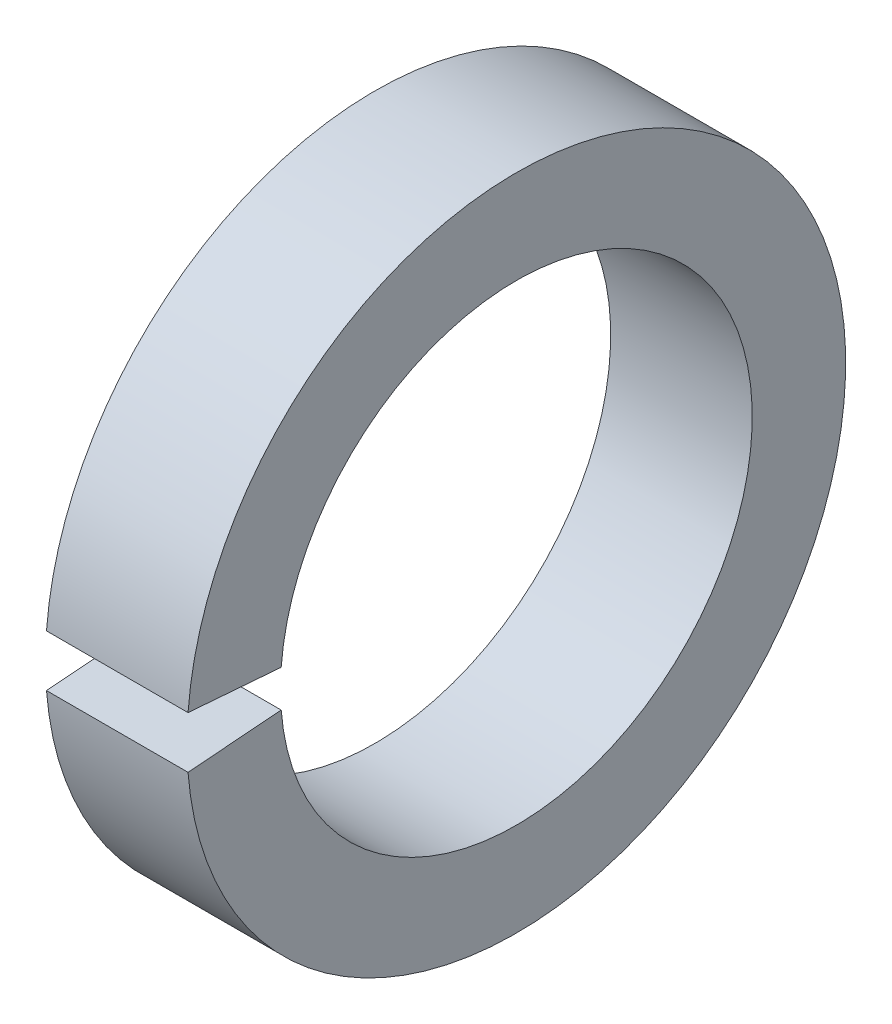
ISO-10303-21;
HEADER;
FILE_DESCRIPTION(('STEP AP214'),'2;1');
FILE_NAME('part.step','',(''),(''),'','','');
FILE_SCHEMA(('AUTOMOTIVE_DESIGN { 1 0 10303 214 1 1 1 1 }'));
ENDSEC;
DATA;
#1=APPLICATION_CONTEXT('core data for automotive mechanical design processes');
#2=APPLICATION_PROTOCOL_DEFINITION('international standard','automotive_design',2000,#1);
#3=PRODUCT_CONTEXT('',#1,'mechanical');
#4=PRODUCT('Part','Part','',(#3));
#5=PRODUCT_RELATED_PRODUCT_CATEGORY('part','',(#4));
#6=PRODUCT_DEFINITION_FORMATION('','',#4);
#7=PRODUCT_DEFINITION_CONTEXT('part definition',#1,'design');
#8=PRODUCT_DEFINITION('design','',#6,#7);
#9=PRODUCT_DEFINITION_SHAPE('','',#8);
#10=(LENGTH_UNIT() NAMED_UNIT(*) SI_UNIT(.MILLI.,.METRE.));
#11=(NAMED_UNIT(*) PLANE_ANGLE_UNIT() SI_UNIT($,.RADIAN.));
#12=(NAMED_UNIT(*) SI_UNIT($,.STERADIAN.) SOLID_ANGLE_UNIT());
#13=UNCERTAINTY_MEASURE_WITH_UNIT(LENGTH_MEASURE(1.E-05),#10,'distance_accuracy_value','');
#14=(GEOMETRIC_REPRESENTATION_CONTEXT(3) GLOBAL_UNCERTAINTY_ASSIGNED_CONTEXT((#13)) GLOBAL_UNIT_ASSIGNED_CONTEXT((#10,
#11,#12)) REPRESENTATION_CONTEXT('',''));
#15=CARTESIAN_POINT('',(0.,0.,0.));
#16=DIRECTION('',(0.,0.,1.));
#17=DIRECTION('',(1.,0.,0.));
#18=AXIS2_PLACEMENT_3D('',#15,#16,#17);
#19=CARTESIAN_POINT('',(-34.9249999999999,0.,0.));
#20=DIRECTION('',(-1.,0.,0.));
#21=DIRECTION('',(0.,0.,1.));
#22=AXIS2_PLACEMENT_3D('',#19,#20,#21);
#23=CYLINDRICAL_SURFACE('',#22,3.302);
#24=CARTESIAN_POINT('',(0.,0.,0.));
#25=DIRECTION('',(-1.,0.,0.));
#26=DIRECTION('',(0.,0.,1.));
#27=AXIS2_PLACEMENT_3D('',#24,#25,#26);
#28=CIRCLE('',#27,3.302);
#29=CARTESIAN_POINT('',(0.,0.259071934093346,3.29182103598679));
#30=VERTEX_POINT('',#29);
#31=CARTESIAN_POINT('',(0.,-0.259071934093346,3.29182103598679));
#32=VERTEX_POINT('',#31);
#33=EDGE_CURVE('E91',#30,#32,#28,.T.);
#34=ORIENTED_EDGE('',*,*,#33,.F.);
#35=DIRECTION('',(-1.,0.,0.));
#36=VECTOR('',#35,1.);
#37=CARTESIAN_POINT('',(-34.9249999999999,0.259071934093346,3.29182103598679));
#38=LINE('',#37,#36);
#39=CARTESIAN_POINT('',(-1.9812,0.259071934093346,3.29182103598679));
#40=VERTEX_POINT('',#39);
#41=EDGE_CURVE('E112',#30,#40,#38,.T.);
#42=ORIENTED_EDGE('',*,*,#41,.T.);
#43=CARTESIAN_POINT('',(-1.9812,0.,0.));
#44=DIRECTION('',(-1.,0.,0.));
#45=DIRECTION('',(0.,0.,1.));
#46=AXIS2_PLACEMENT_3D('',#43,#44,#45);
#47=CIRCLE('',#46,3.302);
#48=CARTESIAN_POINT('',(-1.9812,-0.259071934093346,3.29182103598679));
#49=VERTEX_POINT('',#48);
#50=EDGE_CURVE('E93',#40,#49,#47,.T.);
#51=ORIENTED_EDGE('',*,*,#50,.T.);
#52=DIRECTION('',(-1.,0.,0.));
#53=VECTOR('',#52,1.);
#54=CARTESIAN_POINT('',(-34.9249999999999,-0.259071934093346,3.29182103598679));
#55=LINE('',#54,#53);
#56=EDGE_CURVE('E60',#32,#49,#55,.T.);
#57=ORIENTED_EDGE('',*,*,#56,.F.);
#58=EDGE_LOOP('',(#34,#42,#51,#57));
#59=FACE_BOUND('',#58,.T.);
#60=ADVANCED_FACE('F38',(#59),#23,.F.);
#61=CARTESIAN_POINT('',(0.,3.302,0.));
#62=DIRECTION('',(-1.,0.,0.));
#63=DIRECTION('',(0.,0.,1.));
#64=AXIS2_PLACEMENT_3D('',#61,#62,#63);
#65=PLANE('',#64);
#66=CARTESIAN_POINT('',(0.,0.,0.));
#67=DIRECTION('',(-1.,0.,0.));
#68=DIRECTION('',(0.,0.,1.));
#69=AXIS2_PLACEMENT_3D('',#66,#67,#68);
#70=CIRCLE('',#69,4.6101);
#71=CARTESIAN_POINT('',(0.,0.361704277214941,4.59588860024309));
#72=VERTEX_POINT('',#71);
#73=CARTESIAN_POINT('',(0.,-0.361704277214941,4.59588860024309));
#74=VERTEX_POINT('',#73);
#75=EDGE_CURVE('E99',#72,#74,#70,.T.);
#76=ORIENTED_EDGE('',*,*,#75,.F.);
#77=DIRECTION('',(0.,0.0784590957278456,0.996917333733128));
#78=VECTOR('',#77,1.);
#79=CARTESIAN_POINT('',(0.,0.,0.));
#80=LINE('',#79,#78);
#81=EDGE_CURVE('E85',#30,#72,#80,.T.);
#82=ORIENTED_EDGE('',*,*,#81,.F.);
#83=ORIENTED_EDGE('',*,*,#33,.T.);
#84=DIRECTION('',(0.,-0.0784590957278456,0.996917333733128));
#85=VECTOR('',#84,1.);
#86=CARTESIAN_POINT('',(0.,0.,0.));
#87=LINE('',#86,#85);
#88=EDGE_CURVE('E76',#32,#74,#87,.T.);
#89=ORIENTED_EDGE('',*,*,#88,.T.);
#90=EDGE_LOOP('',(#76,#82,#83,#89));
#91=FACE_BOUND('',#90,.T.);
#92=ADVANCED_FACE('F97',(#91),#65,.F.);
#93=CARTESIAN_POINT('',(-34.9249999999999,0.,0.));
#94=DIRECTION('',(-1.,0.,0.));
#95=DIRECTION('',(0.,0.,1.));
#96=AXIS2_PLACEMENT_3D('',#93,#94,#95);
#97=CYLINDRICAL_SURFACE('',#96,4.6101);
#98=CARTESIAN_POINT('',(-1.9812,0.,0.));
#99=DIRECTION('',(-1.,0.,0.));
#100=DIRECTION('',(0.,0.,1.));
#101=AXIS2_PLACEMENT_3D('',#98,#99,#100);
#102=CIRCLE('',#101,4.6101);
#103=CARTESIAN_POINT('',(-1.9812,0.361704277214941,4.59588860024309));
#104=VERTEX_POINT('',#103);
#105=CARTESIAN_POINT('',(-1.9812,-0.361704277214941,4.59588860024309));
#106=VERTEX_POINT('',#105);
#107=EDGE_CURVE('E104',#104,#106,#102,.T.);
#108=ORIENTED_EDGE('',*,*,#107,.F.);
#109=DIRECTION('',(-1.,0.,0.));
#110=VECTOR('',#109,1.);
#111=CARTESIAN_POINT('',(-34.9249999999999,0.361704277214941,4.59588860024309));
#112=LINE('',#111,#110);
#113=EDGE_CURVE('E53',#104,#72,#112,.F.);
#114=ORIENTED_EDGE('',*,*,#113,.T.);
#115=ORIENTED_EDGE('',*,*,#75,.T.);
#116=DIRECTION('',(-1.,0.,0.));
#117=VECTOR('',#116,1.);
#118=CARTESIAN_POINT('',(-34.9249999999999,-0.361704277214941,4.59588860024309));
#119=LINE('',#118,#117);
#120=EDGE_CURVE('E79',#106,#74,#119,.F.);
#121=ORIENTED_EDGE('',*,*,#120,.F.);
#122=EDGE_LOOP('',(#108,#114,#115,#121));
#123=FACE_BOUND('',#122,.T.);
#124=ADVANCED_FACE('F124',(#123),#97,.T.);
#125=CARTESIAN_POINT('',(-1.9812,4.6101,0.));
#126=DIRECTION('',(1.,0.,0.));
#127=DIRECTION('',(0.,0.,-1.));
#128=AXIS2_PLACEMENT_3D('',#125,#126,#127);
#129=PLANE('',#128);
#130=ORIENTED_EDGE('',*,*,#50,.F.);
#131=DIRECTION('',(0.,0.0784590957278456,0.996917333733128));
#132=VECTOR('',#131,1.);
#133=CARTESIAN_POINT('',(-1.9812,0.0283789905111782,0.360589263640987));
#134=LINE('',#133,#132);
#135=EDGE_CURVE('E11',#40,#104,#134,.T.);
#136=ORIENTED_EDGE('',*,*,#135,.T.);
#137=ORIENTED_EDGE('',*,*,#107,.T.);
#138=DIRECTION('',(0.,-0.0784590957278456,0.996917333733128));
#139=VECTOR('',#138,1.);
#140=CARTESIAN_POINT('',(-1.9812,0.0283789905111782,-0.360589263640987));
#141=LINE('',#140,#139);
#142=EDGE_CURVE('E46',#49,#106,#141,.T.);
#143=ORIENTED_EDGE('',*,*,#142,.F.);
#144=EDGE_LOOP('',(#130,#136,#137,#143));
#145=FACE_BOUND('',#144,.T.);
#146=ADVANCED_FACE('F126',(#145),#129,.F.);
#147=CARTESIAN_POINT('',(-1.9812,0.,0.));
#148=DIRECTION('',(0.,0.996917333733128,0.0784590957278456));
#149=DIRECTION('',(0.,-0.0784590957278456,0.996917333733128));
#150=AXIS2_PLACEMENT_3D('',#147,#148,#149);
#151=PLANE('',#150);
#152=ORIENTED_EDGE('',*,*,#56,.T.);
#153=ORIENTED_EDGE('',*,*,#142,.T.);
#154=ORIENTED_EDGE('',*,*,#120,.T.);
#155=ORIENTED_EDGE('',*,*,#88,.F.);
#156=EDGE_LOOP('',(#152,#153,#154,#155));
#157=FACE_BOUND('',#156,.T.);
#158=ADVANCED_FACE('F77',(#157),#151,.T.);
#159=CARTESIAN_POINT('',(-1.9812,0.,0.));
#160=DIRECTION('',(0.,0.996917333733128,-0.0784590957278456));
#161=DIRECTION('',(0.,0.0784590957278456,0.996917333733128));
#162=AXIS2_PLACEMENT_3D('',#159,#160,#161);
#163=PLANE('',#162);
#164=ORIENTED_EDGE('',*,*,#81,.T.);
#165=ORIENTED_EDGE('',*,*,#113,.F.);
#166=ORIENTED_EDGE('',*,*,#135,.F.);
#167=ORIENTED_EDGE('',*,*,#41,.F.);
#168=EDGE_LOOP('',(#164,#165,#166,#167));
#169=FACE_BOUND('',#168,.T.);
#170=ADVANCED_FACE('F121',(#169),#163,.F.);
#171=CLOSED_SHELL('',(#60,#92,#124,#146,#158,#170));
#172=MANIFOLD_SOLID_BREP('B2',#171);
#173=ADVANCED_BREP_SHAPE_REPRESENTATION('',(#18,#172),#14);
#174=SHAPE_DEFINITION_REPRESENTATION(#9,#173);
ENDSEC;
END-ISO-10303-21;
